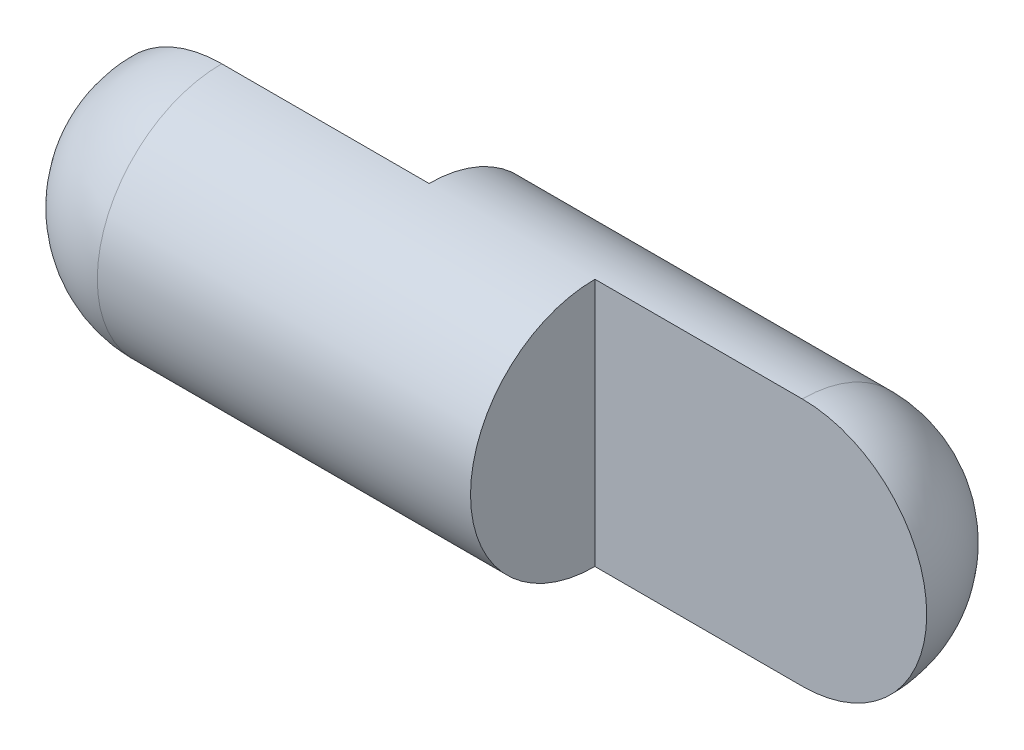
ISO-10303-21;
HEADER;
FILE_DESCRIPTION(('STEP AP214'),'2;1');
FILE_NAME('part.step','',(''),(''),'','','');
FILE_SCHEMA(('AUTOMOTIVE_DESIGN { 1 0 10303 214 1 1 1 1 }'));
ENDSEC;
DATA;
#1=APPLICATION_CONTEXT('core data for automotive mechanical design processes');
#2=APPLICATION_PROTOCOL_DEFINITION('international standard','automotive_design',2000,#1);
#3=PRODUCT_CONTEXT('',#1,'mechanical');
#4=PRODUCT('Part','Part','',(#3));
#5=PRODUCT_RELATED_PRODUCT_CATEGORY('part','',(#4));
#6=PRODUCT_DEFINITION_FORMATION('','',#4);
#7=PRODUCT_DEFINITION_CONTEXT('part definition',#1,'design');
#8=PRODUCT_DEFINITION('design','',#6,#7);
#9=PRODUCT_DEFINITION_SHAPE('','',#8);
#10=(LENGTH_UNIT() NAMED_UNIT(*) SI_UNIT(.MILLI.,.METRE.));
#11=(NAMED_UNIT(*) PLANE_ANGLE_UNIT() SI_UNIT($,.RADIAN.));
#12=(NAMED_UNIT(*) SI_UNIT($,.STERADIAN.) SOLID_ANGLE_UNIT());
#13=UNCERTAINTY_MEASURE_WITH_UNIT(LENGTH_MEASURE(1.E-05),#10,'distance_accuracy_value','');
#14=(GEOMETRIC_REPRESENTATION_CONTEXT(3) GLOBAL_UNCERTAINTY_ASSIGNED_CONTEXT((#13)) GLOBAL_UNIT_ASSIGNED_CONTEXT((#10,
#11,#12)) REPRESENTATION_CONTEXT('',''));
#15=CARTESIAN_POINT('',(0.,0.,0.));
#16=DIRECTION('',(0.,0.,1.));
#17=DIRECTION('',(1.,0.,0.));
#18=AXIS2_PLACEMENT_3D('',#15,#16,#17);
#19=CARTESIAN_POINT('',(0.,0.,0.));
#20=DIRECTION('',(-1.,0.,0.));
#21=DIRECTION('',(0.,-1.,0.));
#22=AXIS2_PLACEMENT_3D('',#19,#20,#21);
#23=SPHERICAL_SURFACE('',#22,75.);
#24=CARTESIAN_POINT('',(0.,0.,0.));
#25=DIRECTION('',(-1.,0.,0.));
#26=DIRECTION('',(0.,0.,1.));
#27=AXIS2_PLACEMENT_3D('',#24,#25,#26);
#28=CIRCLE('',#27,75.);
#29=CARTESIAN_POINT('',(0.,-75.,-5.2372220082647E-13));
#30=VERTEX_POINT('',#29);
#31=CARTESIAN_POINT('',(0.,75.,0.));
#32=VERTEX_POINT('',#31);
#33=EDGE_CURVE('E50',#30,#32,#28,.T.);
#34=ORIENTED_EDGE('',*,*,#33,.T.);
#35=CARTESIAN_POINT('',(0.,0.,0.));
#36=DIRECTION('',(0.,0.,-1.));
#37=DIRECTION('',(1.,0.,0.));
#38=AXIS2_PLACEMENT_3D('',#35,#36,#37);
#39=CIRCLE('',#38,75.);
#40=EDGE_CURVE('E109',#30,#32,#39,.T.);
#41=ORIENTED_EDGE('',*,*,#40,.F.);
#42=EDGE_LOOP('',(#34,#41));
#43=FACE_BOUND('',#42,.T.);
#44=ADVANCED_FACE('F41',(#43),#23,.T.);
#45=CARTESIAN_POINT('',(225.,0.,0.));
#46=DIRECTION('',(-1.,0.,0.));
#47=DIRECTION('',(0.,0.,1.));
#48=AXIS2_PLACEMENT_3D('',#45,#46,#47);
#49=PLANE('',#48);
#50=CARTESIAN_POINT('',(225.,0.,0.));
#51=DIRECTION('',(-1.,0.,0.));
#52=DIRECTION('',(0.,0.,1.));
#53=AXIS2_PLACEMENT_3D('',#50,#51,#52);
#54=CIRCLE('',#53,75.);
#55=CARTESIAN_POINT('',(225.,-75.,-5.2372220082647E-13));
#56=VERTEX_POINT('',#55);
#57=CARTESIAN_POINT('',(225.,75.,0.));
#58=VERTEX_POINT('',#57);
#59=EDGE_CURVE('E11',#56,#58,#54,.T.);
#60=ORIENTED_EDGE('',*,*,#59,.F.);
#61=DIRECTION('',(0.,-1.,0.));
#62=VECTOR('',#61,1.);
#63=CARTESIAN_POINT('',(225.,0.,0.));
#64=LINE('',#63,#62);
#65=EDGE_CURVE('E90',#58,#56,#64,.T.);
#66=ORIENTED_EDGE('',*,*,#65,.F.);
#67=EDGE_LOOP('',(#60,#66));
#68=FACE_BOUND('',#67,.T.);
#69=ADVANCED_FACE('F43',(#68),#49,.F.);
#70=CARTESIAN_POINT('',(-97.7960834288232,0.,0.));
#71=DIRECTION('',(-1.,0.,0.));
#72=DIRECTION('',(0.,0.,1.));
#73=AXIS2_PLACEMENT_3D('',#70,#71,#72);
#74=CYLINDRICAL_SURFACE('',#73,75.);
#75=DIRECTION('',(1.,0.,0.));
#76=VECTOR('',#75,1.);
#77=CARTESIAN_POINT('',(0.,-75.,0.));
#78=LINE('',#77,#76);
#79=CARTESIAN_POINT('',(350.,-75.,0.));
#80=VERTEX_POINT('',#79);
#81=EDGE_CURVE('E85',#56,#80,#78,.T.);
#82=ORIENTED_EDGE('',*,*,#81,.F.);
#83=ORIENTED_EDGE('',*,*,#59,.T.);
#84=DIRECTION('',(1.,0.,0.));
#85=VECTOR('',#84,1.);
#86=CARTESIAN_POINT('',(0.,75.,5.2372220082647E-13));
#87=LINE('',#86,#85);
#88=CARTESIAN_POINT('',(350.,75.,5.2372220082647E-13));
#89=VERTEX_POINT('',#88);
#90=EDGE_CURVE('E94',#58,#89,#87,.T.);
#91=ORIENTED_EDGE('',*,*,#90,.T.);
#92=CARTESIAN_POINT('',(350.,0.,0.));
#93=DIRECTION('',(-1.,0.,0.));
#94=DIRECTION('',(0.,0.,1.));
#95=AXIS2_PLACEMENT_3D('',#92,#93,#94);
#96=CIRCLE('',#95,75.);
#97=EDGE_CURVE('E99',#89,#80,#96,.T.);
#98=ORIENTED_EDGE('',*,*,#97,.T.);
#99=EDGE_LOOP('',(#82,#83,#91,#98));
#100=FACE_BOUND('',#99,.T.);
#101=DIRECTION('',(1.,0.,0.));
#102=VECTOR('',#101,1.);
#103=CARTESIAN_POINT('',(0.,-75.,-5.2372220082647E-13));
#104=LINE('',#103,#102);
#105=CARTESIAN_POINT('',(125.,-75.,-5.2372220082647E-13));
#106=VERTEX_POINT('',#105);
#107=EDGE_CURVE('E119',#30,#106,#104,.T.);
#108=ORIENTED_EDGE('',*,*,#107,.T.);
#109=CARTESIAN_POINT('',(125.,0.,0.));
#110=DIRECTION('',(-1.,0.,0.));
#111=DIRECTION('',(0.,0.,1.));
#112=AXIS2_PLACEMENT_3D('',#109,#110,#111);
#113=CIRCLE('',#112,75.);
#114=CARTESIAN_POINT('',(125.,75.,5.2372220082647E-13));
#115=VERTEX_POINT('',#114);
#116=EDGE_CURVE('E105',#115,#106,#113,.T.);
#117=ORIENTED_EDGE('',*,*,#116,.F.);
#118=DIRECTION('',(1.,0.,0.));
#119=VECTOR('',#118,1.);
#120=CARTESIAN_POINT('',(0.,75.,0.));
#121=LINE('',#120,#119);
#122=EDGE_CURVE('E104',#32,#115,#121,.T.);
#123=ORIENTED_EDGE('',*,*,#122,.F.);
#124=ORIENTED_EDGE('',*,*,#33,.F.);
#125=EDGE_LOOP('',(#108,#117,#123,#124));
#126=FACE_BOUND('',#125,.T.);
#127=ADVANCED_FACE('F102',(#100,#126),#74,.T.);
#128=CARTESIAN_POINT('',(0.,0.,0.));
#129=DIRECTION('',(0.,0.,-1.));
#130=DIRECTION('',(1.,0.,0.));
#131=AXIS2_PLACEMENT_3D('',#128,#129,#130);
#132=PLANE('',#131);
#133=DIRECTION('',(0.,1.,0.));
#134=VECTOR('',#133,1.);
#135=CARTESIAN_POINT('',(125.,0.,0.));
#136=LINE('',#135,#134);
#137=EDGE_CURVE('E57',#106,#115,#136,.T.);
#138=ORIENTED_EDGE('',*,*,#137,.F.);
#139=ORIENTED_EDGE('',*,*,#107,.F.);
#140=ORIENTED_EDGE('',*,*,#40,.T.);
#141=ORIENTED_EDGE('',*,*,#122,.T.);
#142=EDGE_LOOP('',(#138,#139,#140,#141));
#143=FACE_BOUND('',#142,.T.);
#144=ADVANCED_FACE('F124',(#143),#132,.T.);
#145=CARTESIAN_POINT('',(0.,0.,0.));
#146=DIRECTION('',(0.,0.,-1.));
#147=DIRECTION('',(1.,0.,0.));
#148=AXIS2_PLACEMENT_3D('',#145,#146,#147);
#149=PLANE('',#148);
#150=ORIENTED_EDGE('',*,*,#90,.F.);
#151=ORIENTED_EDGE('',*,*,#65,.T.);
#152=ORIENTED_EDGE('',*,*,#81,.T.);
#153=CARTESIAN_POINT('',(350.,0.,0.));
#154=DIRECTION('',(0.,0.,-1.));
#155=DIRECTION('',(1.,0.,0.));
#156=AXIS2_PLACEMENT_3D('',#153,#154,#155);
#157=CIRCLE('',#156,75.0000000000001);
#158=EDGE_CURVE('E89',#89,#80,#157,.T.);
#159=ORIENTED_EDGE('',*,*,#158,.F.);
#160=EDGE_LOOP('',(#150,#151,#152,#159));
#161=FACE_BOUND('',#160,.T.);
#162=ADVANCED_FACE('F88',(#161),#149,.F.);
#163=CARTESIAN_POINT('',(350.,0.,0.));
#164=DIRECTION('',(-1.,0.,0.));
#165=DIRECTION('',(0.,1.,0.));
#166=AXIS2_PLACEMENT_3D('',#163,#164,#165);
#167=SPHERICAL_SURFACE('',#166,75.0000000000001);
#168=ORIENTED_EDGE('',*,*,#158,.T.);
#169=ORIENTED_EDGE('',*,*,#97,.F.);
#170=EDGE_LOOP('',(#168,#169));
#171=FACE_BOUND('',#170,.T.);
#172=ADVANCED_FACE('F98',(#171),#167,.T.);
#173=CARTESIAN_POINT('',(125.,0.,0.));
#174=DIRECTION('',(-1.,0.,0.));
#175=DIRECTION('',(0.,0.,1.));
#176=AXIS2_PLACEMENT_3D('',#173,#174,#175);
#177=PLANE('',#176);
#178=ORIENTED_EDGE('',*,*,#137,.T.);
#179=ORIENTED_EDGE('',*,*,#116,.T.);
#180=EDGE_LOOP('',(#178,#179));
#181=FACE_BOUND('',#180,.T.);
#182=ADVANCED_FACE('F126',(#181),#177,.T.);
#183=CLOSED_SHELL('',(#44,#69,#127,#144,#162,#172,#182));
#184=MANIFOLD_SOLID_BREP('B2',#183);
#185=ADVANCED_BREP_SHAPE_REPRESENTATION('',(#18,#184),#14);
#186=SHAPE_DEFINITION_REPRESENTATION(#9,#185);
ENDSEC;
END-ISO-10303-21;
